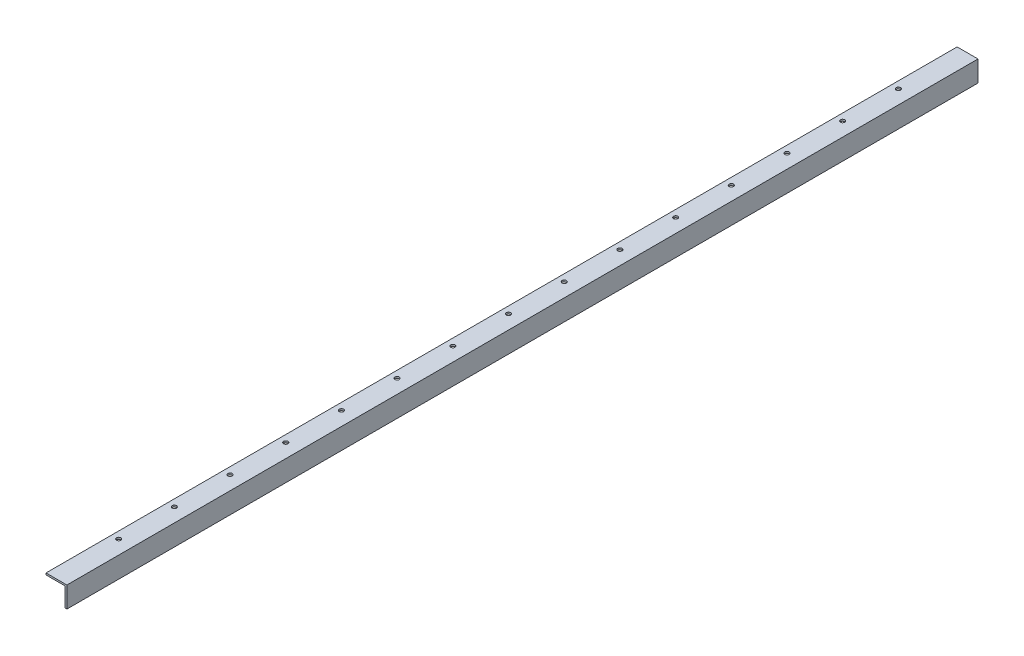
ISO-10303-21;
HEADER;
FILE_DESCRIPTION(('STEP AP214'),'2;1');
FILE_NAME('part.step','',(''),(''),'','','');
FILE_SCHEMA(('AUTOMOTIVE_DESIGN { 1 0 10303 214 1 1 1 1 }'));
ENDSEC;
DATA;
#1=APPLICATION_CONTEXT('core data for automotive mechanical design processes');
#2=APPLICATION_PROTOCOL_DEFINITION('international standard','automotive_design',2000,#1);
#3=PRODUCT_CONTEXT('',#1,'mechanical');
#4=PRODUCT('Part','Part','',(#3));
#5=PRODUCT_RELATED_PRODUCT_CATEGORY('part','',(#4));
#6=PRODUCT_DEFINITION_FORMATION('','',#4);
#7=PRODUCT_DEFINITION_CONTEXT('part definition',#1,'design');
#8=PRODUCT_DEFINITION('design','',#6,#7);
#9=PRODUCT_DEFINITION_SHAPE('','',#8);
#10=(LENGTH_UNIT() NAMED_UNIT(*) SI_UNIT(.MILLI.,.METRE.));
#11=(NAMED_UNIT(*) PLANE_ANGLE_UNIT() SI_UNIT($,.RADIAN.));
#12=(NAMED_UNIT(*) SI_UNIT($,.STERADIAN.) SOLID_ANGLE_UNIT());
#13=UNCERTAINTY_MEASURE_WITH_UNIT(LENGTH_MEASURE(1.E-05),#10,'distance_accuracy_value','');
#14=(GEOMETRIC_REPRESENTATION_CONTEXT(3) GLOBAL_UNCERTAINTY_ASSIGNED_CONTEXT((#13)) GLOBAL_UNIT_ASSIGNED_CONTEXT((#10,
#11,#12)) REPRESENTATION_CONTEXT('',''));
#15=CARTESIAN_POINT('',(0.,0.,0.));
#16=DIRECTION('',(0.,0.,1.));
#17=DIRECTION('',(1.,0.,0.));
#18=AXIS2_PLACEMENT_3D('',#15,#16,#17);
#19=CARTESIAN_POINT('',(-25.4,-41.275,1542.25625));
#20=DIRECTION('',(0.,1.,0.));
#21=DIRECTION('',(0.,0.,1.));
#22=AXIS2_PLACEMENT_3D('',#19,#20,#21);
#23=CYLINDRICAL_SURFACE('',#22,3.96874999999999);
#24=CARTESIAN_POINT('',(-25.4,-3.175,1542.25625));
#25=DIRECTION('',(0.,1.,0.));
#26=DIRECTION('',(0.,0.,1.));
#27=AXIS2_PLACEMENT_3D('',#24,#25,#26);
#28=CIRCLE('',#27,3.96874999999999);
#29=CARTESIAN_POINT('',(-25.4,-3.175,1546.225));
#30=VERTEX_POINT('',#29);
#31=EDGE_CURVE('E42',#30,#30,#28,.T.);
#32=ORIENTED_EDGE('',*,*,#31,.F.);
#33=EDGE_LOOP('',(#32));
#34=FACE_BOUND('',#33,.T.);
#35=CARTESIAN_POINT('',(-25.4,0.,1542.25625));
#36=DIRECTION('',(0.,-1.,0.));
#37=DIRECTION('',(1.,0.,0.));
#38=AXIS2_PLACEMENT_3D('',#35,#36,#37);
#39=CIRCLE('',#38,3.96874999999999);
#40=CARTESIAN_POINT('',(-21.43125,0.,1542.25625));
#41=VERTEX_POINT('',#40);
#42=EDGE_CURVE('E11',#41,#41,#39,.T.);
#43=ORIENTED_EDGE('',*,*,#42,.F.);
#44=EDGE_LOOP('',(#43));
#45=FACE_BOUND('',#44,.T.);
#46=ADVANCED_FACE('F34',(#34,#45),#23,.F.);
#47=CARTESIAN_POINT('',(-25.4,-41.275,1440.65625));
#48=DIRECTION('',(0.,1.,0.));
#49=DIRECTION('',(0.,0.,1.));
#50=AXIS2_PLACEMENT_3D('',#47,#48,#49);
#51=CYLINDRICAL_SURFACE('',#50,3.96874999999999);
#52=CARTESIAN_POINT('',(-25.4,-3.175,1440.65625));
#53=DIRECTION('',(0.,1.,0.));
#54=DIRECTION('',(0.,0.,1.));
#55=AXIS2_PLACEMENT_3D('',#52,#53,#54);
#56=CIRCLE('',#55,3.96874999999999);
#57=CARTESIAN_POINT('',(-25.4,-3.175,1444.625));
#58=VERTEX_POINT('',#57);
#59=EDGE_CURVE('E210',#58,#58,#56,.T.);
#60=ORIENTED_EDGE('',*,*,#59,.F.);
#61=EDGE_LOOP('',(#60));
#62=FACE_BOUND('',#61,.T.);
#63=CARTESIAN_POINT('',(-25.4,0.,1440.65625));
#64=DIRECTION('',(0.,-1.,0.));
#65=DIRECTION('',(1.,0.,0.));
#66=AXIS2_PLACEMENT_3D('',#63,#64,#65);
#67=CIRCLE('',#66,3.96874999999999);
#68=CARTESIAN_POINT('',(-21.43125,0.,1440.65625));
#69=VERTEX_POINT('',#68);
#70=EDGE_CURVE('E213',#69,#69,#67,.T.);
#71=ORIENTED_EDGE('',*,*,#70,.F.);
#72=EDGE_LOOP('',(#71));
#73=FACE_BOUND('',#72,.T.);
#74=ADVANCED_FACE('F221',(#62,#73),#51,.F.);
#75=CARTESIAN_POINT('',(-25.4,-41.275,1339.05625));
#76=DIRECTION('',(0.,1.,0.));
#77=DIRECTION('',(0.,0.,1.));
#78=AXIS2_PLACEMENT_3D('',#75,#76,#77);
#79=CYLINDRICAL_SURFACE('',#78,3.96874999999999);
#80=CARTESIAN_POINT('',(-25.4,-3.175,1339.05625));
#81=DIRECTION('',(0.,1.,0.));
#82=DIRECTION('',(0.,0.,1.));
#83=AXIS2_PLACEMENT_3D('',#80,#81,#82);
#84=CIRCLE('',#83,3.96874999999999);
#85=CARTESIAN_POINT('',(-25.4,-3.175,1343.025));
#86=VERTEX_POINT('',#85);
#87=EDGE_CURVE('E204',#86,#86,#84,.T.);
#88=ORIENTED_EDGE('',*,*,#87,.F.);
#89=EDGE_LOOP('',(#88));
#90=FACE_BOUND('',#89,.T.);
#91=CARTESIAN_POINT('',(-25.4,0.,1339.05625));
#92=DIRECTION('',(0.,-1.,0.));
#93=DIRECTION('',(1.,0.,0.));
#94=AXIS2_PLACEMENT_3D('',#91,#92,#93);
#95=CIRCLE('',#94,3.96874999999999);
#96=CARTESIAN_POINT('',(-21.43125,0.,1339.05625));
#97=VERTEX_POINT('',#96);
#98=EDGE_CURVE('E207',#97,#97,#95,.T.);
#99=ORIENTED_EDGE('',*,*,#98,.F.);
#100=EDGE_LOOP('',(#99));
#101=FACE_BOUND('',#100,.T.);
#102=ADVANCED_FACE('F281',(#90,#101),#79,.F.);
#103=CARTESIAN_POINT('',(-25.4,-41.275,1237.45625));
#104=DIRECTION('',(0.,1.,0.));
#105=DIRECTION('',(0.,0.,1.));
#106=AXIS2_PLACEMENT_3D('',#103,#104,#105);
#107=CYLINDRICAL_SURFACE('',#106,3.96874999999999);
#108=CARTESIAN_POINT('',(-25.4,-3.175,1237.45625));
#109=DIRECTION('',(0.,1.,0.));
#110=DIRECTION('',(0.,0.,1.));
#111=AXIS2_PLACEMENT_3D('',#108,#109,#110);
#112=CIRCLE('',#111,3.96874999999999);
#113=CARTESIAN_POINT('',(-25.4,-3.175,1241.425));
#114=VERTEX_POINT('',#113);
#115=EDGE_CURVE('E198',#114,#114,#112,.T.);
#116=ORIENTED_EDGE('',*,*,#115,.F.);
#117=EDGE_LOOP('',(#116));
#118=FACE_BOUND('',#117,.T.);
#119=CARTESIAN_POINT('',(-25.4,0.,1237.45625));
#120=DIRECTION('',(0.,-1.,0.));
#121=DIRECTION('',(1.,0.,0.));
#122=AXIS2_PLACEMENT_3D('',#119,#120,#121);
#123=CIRCLE('',#122,3.96874999999999);
#124=CARTESIAN_POINT('',(-21.43125,0.,1237.45625));
#125=VERTEX_POINT('',#124);
#126=EDGE_CURVE('E201',#125,#125,#123,.T.);
#127=ORIENTED_EDGE('',*,*,#126,.F.);
#128=EDGE_LOOP('',(#127));
#129=FACE_BOUND('',#128,.T.);
#130=ADVANCED_FACE('F277',(#118,#129),#107,.F.);
#131=CARTESIAN_POINT('',(-25.4,-41.275,1135.85625));
#132=DIRECTION('',(0.,1.,0.));
#133=DIRECTION('',(0.,0.,1.));
#134=AXIS2_PLACEMENT_3D('',#131,#132,#133);
#135=CYLINDRICAL_SURFACE('',#134,3.96874999999999);
#136=CARTESIAN_POINT('',(-25.4,-3.175,1135.85625));
#137=DIRECTION('',(0.,1.,0.));
#138=DIRECTION('',(0.,0.,1.));
#139=AXIS2_PLACEMENT_3D('',#136,#137,#138);
#140=CIRCLE('',#139,3.96874999999999);
#141=CARTESIAN_POINT('',(-25.4,-3.175,1139.825));
#142=VERTEX_POINT('',#141);
#143=EDGE_CURVE('E192',#142,#142,#140,.T.);
#144=ORIENTED_EDGE('',*,*,#143,.F.);
#145=EDGE_LOOP('',(#144));
#146=FACE_BOUND('',#145,.T.);
#147=CARTESIAN_POINT('',(-25.4,0.,1135.85625));
#148=DIRECTION('',(0.,-1.,0.));
#149=DIRECTION('',(1.,0.,0.));
#150=AXIS2_PLACEMENT_3D('',#147,#148,#149);
#151=CIRCLE('',#150,3.96874999999999);
#152=CARTESIAN_POINT('',(-21.43125,0.,1135.85625));
#153=VERTEX_POINT('',#152);
#154=EDGE_CURVE('E195',#153,#153,#151,.T.);
#155=ORIENTED_EDGE('',*,*,#154,.F.);
#156=EDGE_LOOP('',(#155));
#157=FACE_BOUND('',#156,.T.);
#158=ADVANCED_FACE('F273',(#146,#157),#135,.F.);
#159=CARTESIAN_POINT('',(-25.4,-41.275,1034.25625));
#160=DIRECTION('',(0.,1.,0.));
#161=DIRECTION('',(0.,0.,1.));
#162=AXIS2_PLACEMENT_3D('',#159,#160,#161);
#163=CYLINDRICAL_SURFACE('',#162,3.96874999999999);
#164=CARTESIAN_POINT('',(-25.4,-3.175,1034.25625));
#165=DIRECTION('',(0.,1.,0.));
#166=DIRECTION('',(0.,0.,1.));
#167=AXIS2_PLACEMENT_3D('',#164,#165,#166);
#168=CIRCLE('',#167,3.96874999999999);
#169=CARTESIAN_POINT('',(-25.4,-3.175,1038.225));
#170=VERTEX_POINT('',#169);
#171=EDGE_CURVE('E186',#170,#170,#168,.T.);
#172=ORIENTED_EDGE('',*,*,#171,.F.);
#173=EDGE_LOOP('',(#172));
#174=FACE_BOUND('',#173,.T.);
#175=CARTESIAN_POINT('',(-25.4,0.,1034.25625));
#176=DIRECTION('',(0.,-1.,0.));
#177=DIRECTION('',(1.,0.,0.));
#178=AXIS2_PLACEMENT_3D('',#175,#176,#177);
#179=CIRCLE('',#178,3.96874999999999);
#180=CARTESIAN_POINT('',(-21.43125,0.,1034.25625));
#181=VERTEX_POINT('',#180);
#182=EDGE_CURVE('E189',#181,#181,#179,.T.);
#183=ORIENTED_EDGE('',*,*,#182,.F.);
#184=EDGE_LOOP('',(#183));
#185=FACE_BOUND('',#184,.T.);
#186=ADVANCED_FACE('F269',(#174,#185),#163,.F.);
#187=CARTESIAN_POINT('',(-25.4,-41.275,932.65625));
#188=DIRECTION('',(0.,1.,0.));
#189=DIRECTION('',(0.,0.,1.));
#190=AXIS2_PLACEMENT_3D('',#187,#188,#189);
#191=CYLINDRICAL_SURFACE('',#190,3.96874999999999);
#192=CARTESIAN_POINT('',(-25.4,-3.175,932.65625));
#193=DIRECTION('',(0.,1.,0.));
#194=DIRECTION('',(0.,0.,1.));
#195=AXIS2_PLACEMENT_3D('',#192,#193,#194);
#196=CIRCLE('',#195,3.96874999999999);
#197=CARTESIAN_POINT('',(-25.4,-3.175,936.625));
#198=VERTEX_POINT('',#197);
#199=EDGE_CURVE('E180',#198,#198,#196,.T.);
#200=ORIENTED_EDGE('',*,*,#199,.F.);
#201=EDGE_LOOP('',(#200));
#202=FACE_BOUND('',#201,.T.);
#203=CARTESIAN_POINT('',(-25.4,0.,932.65625));
#204=DIRECTION('',(0.,-1.,0.));
#205=DIRECTION('',(1.,0.,0.));
#206=AXIS2_PLACEMENT_3D('',#203,#204,#205);
#207=CIRCLE('',#206,3.96874999999999);
#208=CARTESIAN_POINT('',(-21.43125,0.,932.65625));
#209=VERTEX_POINT('',#208);
#210=EDGE_CURVE('E183',#209,#209,#207,.T.);
#211=ORIENTED_EDGE('',*,*,#210,.F.);
#212=EDGE_LOOP('',(#211));
#213=FACE_BOUND('',#212,.T.);
#214=ADVANCED_FACE('F265',(#202,#213),#191,.F.);
#215=CARTESIAN_POINT('',(-25.4,-41.275,831.05625));
#216=DIRECTION('',(0.,1.,0.));
#217=DIRECTION('',(0.,0.,1.));
#218=AXIS2_PLACEMENT_3D('',#215,#216,#217);
#219=CYLINDRICAL_SURFACE('',#218,3.96874999999999);
#220=CARTESIAN_POINT('',(-25.4,-3.175,831.05625));
#221=DIRECTION('',(0.,1.,0.));
#222=DIRECTION('',(0.,0.,1.));
#223=AXIS2_PLACEMENT_3D('',#220,#221,#222);
#224=CIRCLE('',#223,3.96874999999999);
#225=CARTESIAN_POINT('',(-25.4,-3.175,835.025));
#226=VERTEX_POINT('',#225);
#227=EDGE_CURVE('E174',#226,#226,#224,.T.);
#228=ORIENTED_EDGE('',*,*,#227,.F.);
#229=EDGE_LOOP('',(#228));
#230=FACE_BOUND('',#229,.T.);
#231=CARTESIAN_POINT('',(-25.4,0.,831.05625));
#232=DIRECTION('',(0.,-1.,0.));
#233=DIRECTION('',(1.,0.,0.));
#234=AXIS2_PLACEMENT_3D('',#231,#232,#233);
#235=CIRCLE('',#234,3.96874999999999);
#236=CARTESIAN_POINT('',(-21.43125,0.,831.05625));
#237=VERTEX_POINT('',#236);
#238=EDGE_CURVE('E177',#237,#237,#235,.T.);
#239=ORIENTED_EDGE('',*,*,#238,.F.);
#240=EDGE_LOOP('',(#239));
#241=FACE_BOUND('',#240,.T.);
#242=ADVANCED_FACE('F261',(#230,#241),#219,.F.);
#243=CARTESIAN_POINT('',(-25.4,-41.275,729.45625));
#244=DIRECTION('',(0.,1.,0.));
#245=DIRECTION('',(0.,0.,1.));
#246=AXIS2_PLACEMENT_3D('',#243,#244,#245);
#247=CYLINDRICAL_SURFACE('',#246,3.96874999999999);
#248=CARTESIAN_POINT('',(-25.4,-3.175,729.45625));
#249=DIRECTION('',(0.,1.,0.));
#250=DIRECTION('',(0.,0.,1.));
#251=AXIS2_PLACEMENT_3D('',#248,#249,#250);
#252=CIRCLE('',#251,3.96874999999999);
#253=CARTESIAN_POINT('',(-25.4,-3.175,733.425));
#254=VERTEX_POINT('',#253);
#255=EDGE_CURVE('E168',#254,#254,#252,.T.);
#256=ORIENTED_EDGE('',*,*,#255,.F.);
#257=EDGE_LOOP('',(#256));
#258=FACE_BOUND('',#257,.T.);
#259=CARTESIAN_POINT('',(-25.4,0.,729.45625));
#260=DIRECTION('',(0.,-1.,0.));
#261=DIRECTION('',(1.,0.,0.));
#262=AXIS2_PLACEMENT_3D('',#259,#260,#261);
#263=CIRCLE('',#262,3.96874999999999);
#264=CARTESIAN_POINT('',(-21.43125,0.,729.45625));
#265=VERTEX_POINT('',#264);
#266=EDGE_CURVE('E171',#265,#265,#263,.T.);
#267=ORIENTED_EDGE('',*,*,#266,.F.);
#268=EDGE_LOOP('',(#267));
#269=FACE_BOUND('',#268,.T.);
#270=ADVANCED_FACE('F257',(#258,#269),#247,.F.);
#271=CARTESIAN_POINT('',(-25.4,-41.275,627.85625));
#272=DIRECTION('',(0.,1.,0.));
#273=DIRECTION('',(0.,0.,1.));
#274=AXIS2_PLACEMENT_3D('',#271,#272,#273);
#275=CYLINDRICAL_SURFACE('',#274,3.96874999999999);
#276=CARTESIAN_POINT('',(-25.4,-3.175,627.85625));
#277=DIRECTION('',(0.,1.,0.));
#278=DIRECTION('',(0.,0.,1.));
#279=AXIS2_PLACEMENT_3D('',#276,#277,#278);
#280=CIRCLE('',#279,3.96874999999999);
#281=CARTESIAN_POINT('',(-25.4,-3.175,631.825));
#282=VERTEX_POINT('',#281);
#283=EDGE_CURVE('E162',#282,#282,#280,.T.);
#284=ORIENTED_EDGE('',*,*,#283,.F.);
#285=EDGE_LOOP('',(#284));
#286=FACE_BOUND('',#285,.T.);
#287=CARTESIAN_POINT('',(-25.4,0.,627.85625));
#288=DIRECTION('',(0.,-1.,0.));
#289=DIRECTION('',(1.,0.,0.));
#290=AXIS2_PLACEMENT_3D('',#287,#288,#289);
#291=CIRCLE('',#290,3.96874999999999);
#292=CARTESIAN_POINT('',(-21.43125,0.,627.85625));
#293=VERTEX_POINT('',#292);
#294=EDGE_CURVE('E165',#293,#293,#291,.T.);
#295=ORIENTED_EDGE('',*,*,#294,.F.);
#296=EDGE_LOOP('',(#295));
#297=FACE_BOUND('',#296,.T.);
#298=ADVANCED_FACE('F253',(#286,#297),#275,.F.);
#299=CARTESIAN_POINT('',(-25.4,-41.275,526.25625));
#300=DIRECTION('',(0.,1.,0.));
#301=DIRECTION('',(0.,0.,1.));
#302=AXIS2_PLACEMENT_3D('',#299,#300,#301);
#303=CYLINDRICAL_SURFACE('',#302,3.96874999999999);
#304=CARTESIAN_POINT('',(-25.4,-3.175,526.25625));
#305=DIRECTION('',(0.,1.,0.));
#306=DIRECTION('',(0.,0.,1.));
#307=AXIS2_PLACEMENT_3D('',#304,#305,#306);
#308=CIRCLE('',#307,3.96874999999999);
#309=CARTESIAN_POINT('',(-25.4,-3.175,530.225));
#310=VERTEX_POINT('',#309);
#311=EDGE_CURVE('E156',#310,#310,#308,.T.);
#312=ORIENTED_EDGE('',*,*,#311,.F.);
#313=EDGE_LOOP('',(#312));
#314=FACE_BOUND('',#313,.T.);
#315=CARTESIAN_POINT('',(-25.4,0.,526.25625));
#316=DIRECTION('',(0.,-1.,0.));
#317=DIRECTION('',(1.,0.,0.));
#318=AXIS2_PLACEMENT_3D('',#315,#316,#317);
#319=CIRCLE('',#318,3.96874999999999);
#320=CARTESIAN_POINT('',(-21.43125,0.,526.25625));
#321=VERTEX_POINT('',#320);
#322=EDGE_CURVE('E159',#321,#321,#319,.T.);
#323=ORIENTED_EDGE('',*,*,#322,.F.);
#324=EDGE_LOOP('',(#323));
#325=FACE_BOUND('',#324,.T.);
#326=ADVANCED_FACE('F249',(#314,#325),#303,.F.);
#327=CARTESIAN_POINT('',(-25.4,-41.275,424.65625));
#328=DIRECTION('',(0.,1.,0.));
#329=DIRECTION('',(0.,0.,1.));
#330=AXIS2_PLACEMENT_3D('',#327,#328,#329);
#331=CYLINDRICAL_SURFACE('',#330,3.96874999999999);
#332=CARTESIAN_POINT('',(-25.4,-3.175,424.65625));
#333=DIRECTION('',(0.,1.,0.));
#334=DIRECTION('',(0.,0.,1.));
#335=AXIS2_PLACEMENT_3D('',#332,#333,#334);
#336=CIRCLE('',#335,3.96874999999999);
#337=CARTESIAN_POINT('',(-25.4,-3.175,428.625));
#338=VERTEX_POINT('',#337);
#339=EDGE_CURVE('E150',#338,#338,#336,.T.);
#340=ORIENTED_EDGE('',*,*,#339,.F.);
#341=EDGE_LOOP('',(#340));
#342=FACE_BOUND('',#341,.T.);
#343=CARTESIAN_POINT('',(-25.4,0.,424.65625));
#344=DIRECTION('',(0.,-1.,0.));
#345=DIRECTION('',(1.,0.,0.));
#346=AXIS2_PLACEMENT_3D('',#343,#344,#345);
#347=CIRCLE('',#346,3.96874999999999);
#348=CARTESIAN_POINT('',(-21.43125,0.,424.65625));
#349=VERTEX_POINT('',#348);
#350=EDGE_CURVE('E153',#349,#349,#347,.T.);
#351=ORIENTED_EDGE('',*,*,#350,.F.);
#352=EDGE_LOOP('',(#351));
#353=FACE_BOUND('',#352,.T.);
#354=ADVANCED_FACE('F245',(#342,#353),#331,.F.);
#355=CARTESIAN_POINT('',(-25.4,-41.275,323.05625));
#356=DIRECTION('',(0.,1.,0.));
#357=DIRECTION('',(0.,0.,1.));
#358=AXIS2_PLACEMENT_3D('',#355,#356,#357);
#359=CYLINDRICAL_SURFACE('',#358,3.96874999999999);
#360=CARTESIAN_POINT('',(-25.4,-3.175,323.05625));
#361=DIRECTION('',(0.,1.,0.));
#362=DIRECTION('',(0.,0.,1.));
#363=AXIS2_PLACEMENT_3D('',#360,#361,#362);
#364=CIRCLE('',#363,3.96874999999999);
#365=CARTESIAN_POINT('',(-25.4,-3.175,327.025));
#366=VERTEX_POINT('',#365);
#367=EDGE_CURVE('E140',#366,#366,#364,.T.);
#368=ORIENTED_EDGE('',*,*,#367,.F.);
#369=EDGE_LOOP('',(#368));
#370=FACE_BOUND('',#369,.T.);
#371=CARTESIAN_POINT('',(-25.4,0.,323.05625));
#372=DIRECTION('',(0.,-1.,0.));
#373=DIRECTION('',(1.,0.,0.));
#374=AXIS2_PLACEMENT_3D('',#371,#372,#373);
#375=CIRCLE('',#374,3.96874999999999);
#376=CARTESIAN_POINT('',(-21.43125,0.,323.05625));
#377=VERTEX_POINT('',#376);
#378=EDGE_CURVE('E147',#377,#377,#375,.T.);
#379=ORIENTED_EDGE('',*,*,#378,.F.);
#380=EDGE_LOOP('',(#379));
#381=FACE_BOUND('',#380,.T.);
#382=ADVANCED_FACE('F236',(#370,#381),#359,.F.);
#383=CARTESIAN_POINT('',(0.,-38.1,1662.1125));
#384=DIRECTION('',(-1.,0.,0.));
#385=DIRECTION('',(0.,0.,1.));
#386=AXIS2_PLACEMENT_3D('',#383,#384,#385);
#387=PLANE('',#386);
#388=DIRECTION('',(0.,1.,0.));
#389=VECTOR('',#388,1.);
#390=CARTESIAN_POINT('',(0.,-38.1,0.));
#391=LINE('',#390,#389);
#392=CARTESIAN_POINT('',(0.,-38.1,0.));
#393=VERTEX_POINT('',#392);
#394=CARTESIAN_POINT('',(0.,0.,0.));
#395=VERTEX_POINT('',#394);
#396=EDGE_CURVE('E120',#393,#395,#391,.T.);
#397=ORIENTED_EDGE('',*,*,#396,.T.);
#398=DIRECTION('',(0.,0.,-1.));
#399=VECTOR('',#398,1.);
#400=CARTESIAN_POINT('',(0.,0.,1662.1125));
#401=LINE('',#400,#399);
#402=CARTESIAN_POINT('',(0.,0.,1662.1125));
#403=VERTEX_POINT('',#402);
#404=EDGE_CURVE('E138',#403,#395,#401,.T.);
#405=ORIENTED_EDGE('',*,*,#404,.F.);
#406=DIRECTION('',(0.,1.,0.));
#407=VECTOR('',#406,1.);
#408=CARTESIAN_POINT('',(0.,-38.1,1662.1125));
#409=LINE('',#408,#407);
#410=CARTESIAN_POINT('',(0.,-38.1,1662.1125));
#411=VERTEX_POINT('',#410);
#412=EDGE_CURVE('E131',#411,#403,#409,.T.);
#413=ORIENTED_EDGE('',*,*,#412,.F.);
#414=DIRECTION('',(0.,0.,-1.));
#415=VECTOR('',#414,1.);
#416=CARTESIAN_POINT('',(0.,-38.1,1662.1125));
#417=LINE('',#416,#415);
#418=EDGE_CURVE('E116',#411,#393,#417,.T.);
#419=ORIENTED_EDGE('',*,*,#418,.T.);
#420=EDGE_LOOP('',(#397,#405,#413,#419));
#421=FACE_BOUND('',#420,.T.);
#422=ADVANCED_FACE('F227',(#421),#387,.F.);
#423=CARTESIAN_POINT('',(0.,0.,1662.1125));
#424=DIRECTION('',(0.,-1.,0.));
#425=DIRECTION('',(1.,0.,0.));
#426=AXIS2_PLACEMENT_3D('',#423,#424,#425);
#427=PLANE('',#426);
#428=CARTESIAN_POINT('',(-25.4,0.,221.45625));
#429=DIRECTION('',(0.,-1.,0.));
#430=DIRECTION('',(1.,0.,0.));
#431=AXIS2_PLACEMENT_3D('',#428,#429,#430);
#432=CIRCLE('',#431,3.96874999999999);
#433=CARTESIAN_POINT('',(-21.43125,0.,221.45625));
#434=VERTEX_POINT('',#433);
#435=EDGE_CURVE('E144',#434,#434,#432,.T.);
#436=ORIENTED_EDGE('',*,*,#435,.T.);
#437=EDGE_LOOP('',(#436));
#438=FACE_BOUND('',#437,.T.);
#439=CARTESIAN_POINT('',(-25.4,0.,119.85625));
#440=DIRECTION('',(0.,-1.,0.));
#441=DIRECTION('',(1.,0.,0.));
#442=AXIS2_PLACEMENT_3D('',#439,#440,#441);
#443=CIRCLE('',#442,3.96874999999999);
#444=CARTESIAN_POINT('',(-21.43125,0.,119.85625));
#445=VERTEX_POINT('',#444);
#446=EDGE_CURVE('E124',#445,#445,#443,.T.);
#447=ORIENTED_EDGE('',*,*,#446,.T.);
#448=EDGE_LOOP('',(#447));
#449=FACE_BOUND('',#448,.T.);
#450=DIRECTION('',(-1.,0.,0.));
#451=VECTOR('',#450,1.);
#452=CARTESIAN_POINT('',(0.,0.,0.));
#453=LINE('',#452,#451);
#454=CARTESIAN_POINT('',(-38.1,0.,0.));
#455=VERTEX_POINT('',#454);
#456=EDGE_CURVE('E123',#395,#455,#453,.T.);
#457=ORIENTED_EDGE('',*,*,#456,.T.);
#458=DIRECTION('',(0.,0.,-1.));
#459=VECTOR('',#458,1.);
#460=CARTESIAN_POINT('',(-38.1,0.,1662.1125));
#461=LINE('',#460,#459);
#462=CARTESIAN_POINT('',(-38.1,0.,1662.1125));
#463=VERTEX_POINT('',#462);
#464=EDGE_CURVE('E135',#463,#455,#461,.T.);
#465=ORIENTED_EDGE('',*,*,#464,.F.);
#466=DIRECTION('',(-1.,0.,0.));
#467=VECTOR('',#466,1.);
#468=CARTESIAN_POINT('',(0.,0.,1662.1125));
#469=LINE('',#468,#467);
#470=EDGE_CURVE('E88',#403,#463,#469,.T.);
#471=ORIENTED_EDGE('',*,*,#470,.F.);
#472=ORIENTED_EDGE('',*,*,#404,.T.);
#473=EDGE_LOOP('',(#457,#465,#471,#472));
#474=FACE_BOUND('',#473,.T.);
#475=ORIENTED_EDGE('',*,*,#378,.T.);
#476=EDGE_LOOP('',(#475));
#477=FACE_BOUND('',#476,.T.);
#478=ORIENTED_EDGE('',*,*,#350,.T.);
#479=EDGE_LOOP('',(#478));
#480=FACE_BOUND('',#479,.T.);
#481=ORIENTED_EDGE('',*,*,#322,.T.);
#482=EDGE_LOOP('',(#481));
#483=FACE_BOUND('',#482,.T.);
#484=ORIENTED_EDGE('',*,*,#294,.T.);
#485=EDGE_LOOP('',(#484));
#486=FACE_BOUND('',#485,.T.);
#487=ORIENTED_EDGE('',*,*,#266,.T.);
#488=EDGE_LOOP('',(#487));
#489=FACE_BOUND('',#488,.T.);
#490=ORIENTED_EDGE('',*,*,#238,.T.);
#491=EDGE_LOOP('',(#490));
#492=FACE_BOUND('',#491,.T.);
#493=ORIENTED_EDGE('',*,*,#210,.T.);
#494=EDGE_LOOP('',(#493));
#495=FACE_BOUND('',#494,.T.);
#496=ORIENTED_EDGE('',*,*,#182,.T.);
#497=EDGE_LOOP('',(#496));
#498=FACE_BOUND('',#497,.T.);
#499=ORIENTED_EDGE('',*,*,#154,.T.);
#500=EDGE_LOOP('',(#499));
#501=FACE_BOUND('',#500,.T.);
#502=ORIENTED_EDGE('',*,*,#126,.T.);
#503=EDGE_LOOP('',(#502));
#504=FACE_BOUND('',#503,.T.);
#505=ORIENTED_EDGE('',*,*,#98,.T.);
#506=EDGE_LOOP('',(#505));
#507=FACE_BOUND('',#506,.T.);
#508=ORIENTED_EDGE('',*,*,#70,.T.);
#509=EDGE_LOOP('',(#508));
#510=FACE_BOUND('',#509,.T.);
#511=ORIENTED_EDGE('',*,*,#42,.T.);
#512=EDGE_LOOP('',(#511));
#513=FACE_BOUND('',#512,.T.);
#514=ADVANCED_FACE('F224',(#438,#449,#474,#477,#480,#483,#486,#489,#492,#495,#498,#501,#504,
#507,#510,#513),#427,.F.);
#515=CARTESIAN_POINT('',(-38.1,0.,1662.1125));
#516=DIRECTION('',(1.,0.,0.));
#517=DIRECTION('',(0.,0.,-1.));
#518=AXIS2_PLACEMENT_3D('',#515,#516,#517);
#519=PLANE('',#518);
#520=DIRECTION('',(0.,-1.,0.));
#521=VECTOR('',#520,1.);
#522=CARTESIAN_POINT('',(-38.1,0.,0.));
#523=LINE('',#522,#521);
#524=CARTESIAN_POINT('',(-38.1,-3.17500000000001,0.));
#525=VERTEX_POINT('',#524);
#526=EDGE_CURVE('E126',#455,#525,#523,.T.);
#527=ORIENTED_EDGE('',*,*,#526,.T.);
#528=DIRECTION('',(0.,0.,-1.));
#529=VECTOR('',#528,1.);
#530=CARTESIAN_POINT('',(-38.1,-3.17500000000001,1662.1125));
#531=LINE('',#530,#529);
#532=CARTESIAN_POINT('',(-38.1,-3.17500000000001,1662.1125));
#533=VERTEX_POINT('',#532);
#534=EDGE_CURVE('E111',#533,#525,#531,.T.);
#535=ORIENTED_EDGE('',*,*,#534,.F.);
#536=DIRECTION('',(0.,-1.,0.));
#537=VECTOR('',#536,1.);
#538=CARTESIAN_POINT('',(-38.1,0.,1662.1125));
#539=LINE('',#538,#537);
#540=EDGE_CURVE('E101',#463,#533,#539,.T.);
#541=ORIENTED_EDGE('',*,*,#540,.F.);
#542=ORIENTED_EDGE('',*,*,#464,.T.);
#543=EDGE_LOOP('',(#527,#535,#541,#542));
#544=FACE_BOUND('',#543,.T.);
#545=ADVANCED_FACE('F226',(#544),#519,.F.);
#546=CARTESIAN_POINT('',(-38.1,-3.17500000000001,1662.1125));
#547=DIRECTION('',(0.,1.,0.));
#548=DIRECTION('',(0.,0.,1.));
#549=AXIS2_PLACEMENT_3D('',#546,#547,#548);
#550=PLANE('',#549);
#551=CARTESIAN_POINT('',(-25.4,-3.175,221.45625));
#552=DIRECTION('',(0.,1.,0.));
#553=DIRECTION('',(0.,0.,1.));
#554=AXIS2_PLACEMENT_3D('',#551,#552,#553);
#555=CIRCLE('',#554,3.96874999999999);
#556=CARTESIAN_POINT('',(-25.4,-3.175,225.425));
#557=VERTEX_POINT('',#556);
#558=EDGE_CURVE('E323',#557,#557,#555,.T.);
#559=ORIENTED_EDGE('',*,*,#558,.T.);
#560=EDGE_LOOP('',(#559));
#561=FACE_BOUND('',#560,.T.);
#562=CARTESIAN_POINT('',(-25.4,-3.175,119.85625));
#563=DIRECTION('',(0.,1.,0.));
#564=DIRECTION('',(0.,0.,1.));
#565=AXIS2_PLACEMENT_3D('',#562,#563,#564);
#566=CIRCLE('',#565,3.96874999999999);
#567=CARTESIAN_POINT('',(-25.4,-3.175,123.825));
#568=VERTEX_POINT('',#567);
#569=EDGE_CURVE('E141',#568,#568,#566,.T.);
#570=ORIENTED_EDGE('',*,*,#569,.T.);
#571=EDGE_LOOP('',(#570));
#572=FACE_BOUND('',#571,.T.);
#573=DIRECTION('',(1.,0.,0.));
#574=VECTOR('',#573,1.);
#575=CARTESIAN_POINT('',(-38.1,-3.17500000000001,0.));
#576=LINE('',#575,#574);
#577=CARTESIAN_POINT('',(-3.17500000000001,-3.17500000000001,0.));
#578=VERTEX_POINT('',#577);
#579=EDGE_CURVE('E110',#525,#578,#576,.T.);
#580=ORIENTED_EDGE('',*,*,#579,.T.);
#581=DIRECTION('',(0.,0.,-1.));
#582=VECTOR('',#581,1.);
#583=CARTESIAN_POINT('',(-3.17500000000001,-3.17500000000001,1662.1125));
#584=LINE('',#583,#582);
#585=CARTESIAN_POINT('',(-3.17500000000001,-3.17500000000001,1662.1125));
#586=VERTEX_POINT('',#585);
#587=EDGE_CURVE('E106',#586,#578,#584,.T.);
#588=ORIENTED_EDGE('',*,*,#587,.F.);
#589=DIRECTION('',(1.,0.,0.));
#590=VECTOR('',#589,1.);
#591=CARTESIAN_POINT('',(-38.1,-3.17500000000001,1662.1125));
#592=LINE('',#591,#590);
#593=EDGE_CURVE('E95',#533,#586,#592,.T.);
#594=ORIENTED_EDGE('',*,*,#593,.F.);
#595=ORIENTED_EDGE('',*,*,#534,.T.);
#596=EDGE_LOOP('',(#580,#588,#594,#595));
#597=FACE_BOUND('',#596,.T.);
#598=ORIENTED_EDGE('',*,*,#367,.T.);
#599=EDGE_LOOP('',(#598));
#600=FACE_BOUND('',#599,.T.);
#601=ORIENTED_EDGE('',*,*,#339,.T.);
#602=EDGE_LOOP('',(#601));
#603=FACE_BOUND('',#602,.T.);
#604=ORIENTED_EDGE('',*,*,#311,.T.);
#605=EDGE_LOOP('',(#604));
#606=FACE_BOUND('',#605,.T.);
#607=ORIENTED_EDGE('',*,*,#283,.T.);
#608=EDGE_LOOP('',(#607));
#609=FACE_BOUND('',#608,.T.);
#610=ORIENTED_EDGE('',*,*,#255,.T.);
#611=EDGE_LOOP('',(#610));
#612=FACE_BOUND('',#611,.T.);
#613=ORIENTED_EDGE('',*,*,#227,.T.);
#614=EDGE_LOOP('',(#613));
#615=FACE_BOUND('',#614,.T.);
#616=ORIENTED_EDGE('',*,*,#199,.T.);
#617=EDGE_LOOP('',(#616));
#618=FACE_BOUND('',#617,.T.);
#619=ORIENTED_EDGE('',*,*,#171,.T.);
#620=EDGE_LOOP('',(#619));
#621=FACE_BOUND('',#620,.T.);
#622=ORIENTED_EDGE('',*,*,#143,.T.);
#623=EDGE_LOOP('',(#622));
#624=FACE_BOUND('',#623,.T.);
#625=ORIENTED_EDGE('',*,*,#115,.T.);
#626=EDGE_LOOP('',(#625));
#627=FACE_BOUND('',#626,.T.);
#628=ORIENTED_EDGE('',*,*,#87,.T.);
#629=EDGE_LOOP('',(#628));
#630=FACE_BOUND('',#629,.T.);
#631=ORIENTED_EDGE('',*,*,#59,.T.);
#632=EDGE_LOOP('',(#631));
#633=FACE_BOUND('',#632,.T.);
#634=ORIENTED_EDGE('',*,*,#31,.T.);
#635=EDGE_LOOP('',(#634));
#636=FACE_BOUND('',#635,.T.);
#637=ADVANCED_FACE('F107',(#561,#572,#597,#600,#603,#606,#609,#612,#615,#618,#621,#624,#627,
#630,#633,#636),#550,.F.);
#638=CARTESIAN_POINT('',(-3.17500000000001,-3.17500000000001,1662.1125));
#639=DIRECTION('',(1.,0.,0.));
#640=DIRECTION('',(0.,1.,0.));
#641=AXIS2_PLACEMENT_3D('',#638,#639,#640);
#642=PLANE('',#641);
#643=DIRECTION('',(0.,-1.,0.));
#644=VECTOR('',#643,1.);
#645=CARTESIAN_POINT('',(-3.17500000000001,-3.17500000000001,0.));
#646=LINE('',#645,#644);
#647=CARTESIAN_POINT('',(-3.175,-38.1,0.));
#648=VERTEX_POINT('',#647);
#649=EDGE_CURVE('E73',#578,#648,#646,.T.);
#650=ORIENTED_EDGE('',*,*,#649,.T.);
#651=DIRECTION('',(0.,0.,-1.));
#652=VECTOR('',#651,1.);
#653=CARTESIAN_POINT('',(-3.175,-38.1,1662.1125));
#654=LINE('',#653,#652);
#655=CARTESIAN_POINT('',(-3.175,-38.1,1662.1125));
#656=VERTEX_POINT('',#655);
#657=EDGE_CURVE('E112',#656,#648,#654,.T.);
#658=ORIENTED_EDGE('',*,*,#657,.F.);
#659=DIRECTION('',(0.,-1.,0.));
#660=VECTOR('',#659,1.);
#661=CARTESIAN_POINT('',(-3.17500000000001,-3.17500000000001,1662.1125));
#662=LINE('',#661,#660);
#663=EDGE_CURVE('E99',#586,#656,#662,.T.);
#664=ORIENTED_EDGE('',*,*,#663,.F.);
#665=ORIENTED_EDGE('',*,*,#587,.T.);
#666=EDGE_LOOP('',(#650,#658,#664,#665));
#667=FACE_BOUND('',#666,.T.);
#668=ADVANCED_FACE('F114',(#667),#642,.F.);
#669=CARTESIAN_POINT('',(-3.175,-38.1,1662.1125));
#670=DIRECTION('',(0.,1.,0.));
#671=DIRECTION('',(0.,0.,1.));
#672=AXIS2_PLACEMENT_3D('',#669,#670,#671);
#673=PLANE('',#672);
#674=DIRECTION('',(1.,0.,0.));
#675=VECTOR('',#674,1.);
#676=CARTESIAN_POINT('',(-3.175,-38.1,0.));
#677=LINE('',#676,#675);
#678=EDGE_CURVE('E79',#648,#393,#677,.T.);
#679=ORIENTED_EDGE('',*,*,#678,.T.);
#680=ORIENTED_EDGE('',*,*,#418,.F.);
#681=DIRECTION('',(1.,0.,0.));
#682=VECTOR('',#681,1.);
#683=CARTESIAN_POINT('',(-3.175,-38.1,1662.1125));
#684=LINE('',#683,#682);
#685=EDGE_CURVE('E50',#656,#411,#684,.T.);
#686=ORIENTED_EDGE('',*,*,#685,.F.);
#687=ORIENTED_EDGE('',*,*,#657,.T.);
#688=EDGE_LOOP('',(#679,#680,#686,#687));
#689=FACE_BOUND('',#688,.T.);
#690=ADVANCED_FACE('F299',(#689),#673,.F.);
#691=CARTESIAN_POINT('',(0.,0.,1662.1125));
#692=DIRECTION('',(0.,0.,1.));
#693=DIRECTION('',(1.,0.,0.));
#694=AXIS2_PLACEMENT_3D('',#691,#692,#693);
#695=PLANE('',#694);
#696=ORIENTED_EDGE('',*,*,#412,.T.);
#697=ORIENTED_EDGE('',*,*,#470,.T.);
#698=ORIENTED_EDGE('',*,*,#540,.T.);
#699=ORIENTED_EDGE('',*,*,#593,.T.);
#700=ORIENTED_EDGE('',*,*,#663,.T.);
#701=ORIENTED_EDGE('',*,*,#685,.T.);
#702=EDGE_LOOP('',(#696,#697,#698,#699,#700,#701));
#703=FACE_BOUND('',#702,.T.);
#704=ADVANCED_FACE('F97',(#703),#695,.T.);
#705=CARTESIAN_POINT('',(0.,0.,0.));
#706=DIRECTION('',(0.,0.,1.));
#707=DIRECTION('',(1.,0.,0.));
#708=AXIS2_PLACEMENT_3D('',#705,#706,#707);
#709=PLANE('',#708);
#710=ORIENTED_EDGE('',*,*,#396,.F.);
#711=ORIENTED_EDGE('',*,*,#678,.F.);
#712=ORIENTED_EDGE('',*,*,#649,.F.);
#713=ORIENTED_EDGE('',*,*,#579,.F.);
#714=ORIENTED_EDGE('',*,*,#526,.F.);
#715=ORIENTED_EDGE('',*,*,#456,.F.);
#716=EDGE_LOOP('',(#710,#711,#712,#713,#714,#715));
#717=FACE_BOUND('',#716,.T.);
#718=ADVANCED_FACE('F306',(#717),#709,.F.);
#719=CARTESIAN_POINT('',(-25.4,-41.275,119.85625));
#720=DIRECTION('',(0.,1.,0.));
#721=DIRECTION('',(0.,0.,1.));
#722=AXIS2_PLACEMENT_3D('',#719,#720,#721);
#723=CYLINDRICAL_SURFACE('',#722,3.96874999999999);
#724=ORIENTED_EDGE('',*,*,#569,.F.);
#725=EDGE_LOOP('',(#724));
#726=FACE_BOUND('',#725,.T.);
#727=ORIENTED_EDGE('',*,*,#446,.F.);
#728=EDGE_LOOP('',(#727));
#729=FACE_BOUND('',#728,.T.);
#730=ADVANCED_FACE('F309',(#726,#729),#723,.F.);
#731=CARTESIAN_POINT('',(-25.4,-41.275,221.45625));
#732=DIRECTION('',(0.,1.,0.));
#733=DIRECTION('',(0.,0.,1.));
#734=AXIS2_PLACEMENT_3D('',#731,#732,#733);
#735=CYLINDRICAL_SURFACE('',#734,3.96874999999999);
#736=ORIENTED_EDGE('',*,*,#558,.F.);
#737=EDGE_LOOP('',(#736));
#738=FACE_BOUND('',#737,.T.);
#739=ORIENTED_EDGE('',*,*,#435,.F.);
#740=EDGE_LOOP('',(#739));
#741=FACE_BOUND('',#740,.T.);
#742=ADVANCED_FACE('F315',(#738,#741),#735,.F.);
#743=CLOSED_SHELL('',(#46,#74,#102,#130,#158,#186,#214,#242,#270,#298,#326,#354,#382,#422,#514,
#545,#637,#668,#690,#704,#718,#730,#742));
#744=MANIFOLD_SOLID_BREP('B2',#743);
#745=ADVANCED_BREP_SHAPE_REPRESENTATION('',(#18,#744),#14);
#746=SHAPE_DEFINITION_REPRESENTATION(#9,#745);
ENDSEC;
END-ISO-10303-21;
